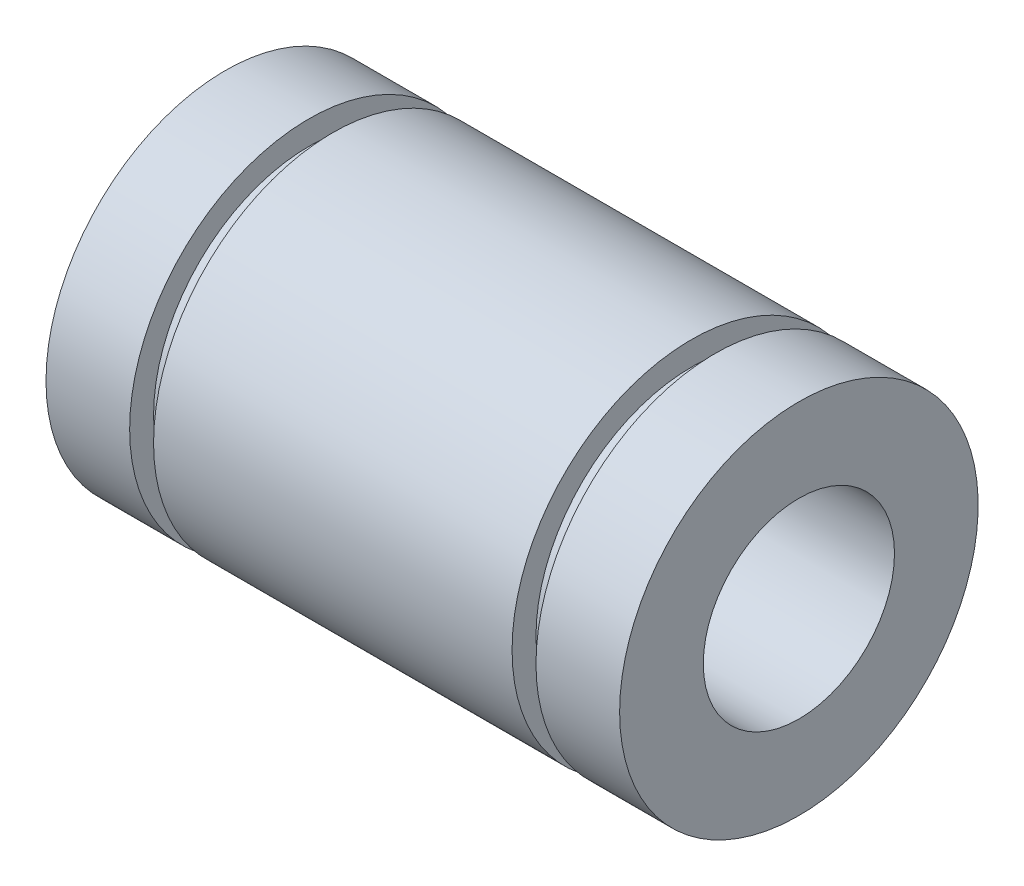
ISO-10303-21;
HEADER;
FILE_DESCRIPTION(('STEP AP214'),'2;1');
FILE_NAME('part.step','',(''),(''),'','','');
FILE_SCHEMA(('AUTOMOTIVE_DESIGN { 1 0 10303 214 1 1 1 1 }'));
ENDSEC;
DATA;
#1=APPLICATION_CONTEXT('core data for automotive mechanical design processes');
#2=APPLICATION_PROTOCOL_DEFINITION('international standard','automotive_design',2000,#1);
#3=PRODUCT_CONTEXT('',#1,'mechanical');
#4=PRODUCT('Part','Part','',(#3));
#5=PRODUCT_RELATED_PRODUCT_CATEGORY('part','',(#4));
#6=PRODUCT_DEFINITION_FORMATION('','',#4);
#7=PRODUCT_DEFINITION_CONTEXT('part definition',#1,'design');
#8=PRODUCT_DEFINITION('design','',#6,#7);
#9=PRODUCT_DEFINITION_SHAPE('','',#8);
#10=(LENGTH_UNIT() NAMED_UNIT(*) SI_UNIT(.MILLI.,.METRE.));
#11=(NAMED_UNIT(*) PLANE_ANGLE_UNIT() SI_UNIT($,.RADIAN.));
#12=(NAMED_UNIT(*) SI_UNIT($,.STERADIAN.) SOLID_ANGLE_UNIT());
#13=UNCERTAINTY_MEASURE_WITH_UNIT(LENGTH_MEASURE(1.E-05),#10,'distance_accuracy_value','');
#14=(GEOMETRIC_REPRESENTATION_CONTEXT(3) GLOBAL_UNCERTAINTY_ASSIGNED_CONTEXT((#13)) GLOBAL_UNIT_ASSIGNED_CONTEXT((#10,
#11,#12)) REPRESENTATION_CONTEXT('',''));
#15=CARTESIAN_POINT('',(0.,0.,0.));
#16=DIRECTION('',(0.,0.,1.));
#17=DIRECTION('',(1.,0.,0.));
#18=AXIS2_PLACEMENT_3D('',#15,#16,#17);
#19=CARTESIAN_POINT('',(0.,0.,0.));
#20=DIRECTION('',(-1.,0.,0.));
#21=DIRECTION('',(0.,0.,1.));
#22=AXIS2_PLACEMENT_3D('',#19,#20,#21);
#23=CYLINDRICAL_SURFACE('',#22,4.);
#24=CARTESIAN_POINT('',(24.,0.,0.));
#25=DIRECTION('',(-1.,0.,0.));
#26=DIRECTION('',(0.,0.,1.));
#27=AXIS2_PLACEMENT_3D('',#24,#25,#26);
#28=CIRCLE('',#27,4.);
#29=CARTESIAN_POINT('',(24.,0.,4.));
#30=VERTEX_POINT('',#29);
#31=EDGE_CURVE('E10',#30,#30,#28,.T.);
#32=ORIENTED_EDGE('',*,*,#31,.F.);
#33=EDGE_LOOP('',(#32));
#34=FACE_BOUND('',#33,.T.);
#35=CARTESIAN_POINT('',(0.,0.,0.));
#36=DIRECTION('',(-1.,0.,0.));
#37=DIRECTION('',(0.,0.,1.));
#38=AXIS2_PLACEMENT_3D('',#35,#36,#37);
#39=CIRCLE('',#38,4.);
#40=CARTESIAN_POINT('',(0.,0.,4.));
#41=VERTEX_POINT('',#40);
#42=EDGE_CURVE('E71',#41,#41,#39,.T.);
#43=ORIENTED_EDGE('',*,*,#42,.T.);
#44=EDGE_LOOP('',(#43));
#45=FACE_BOUND('',#44,.T.);
#46=ADVANCED_FACE('F31',(#34,#45),#23,.F.);
#47=CARTESIAN_POINT('',(24.,4.,0.));
#48=DIRECTION('',(-1.,0.,0.));
#49=DIRECTION('',(0.,0.,1.));
#50=AXIS2_PLACEMENT_3D('',#47,#48,#49);
#51=PLANE('',#50);
#52=CARTESIAN_POINT('',(24.,0.,0.));
#53=DIRECTION('',(-1.,0.,0.));
#54=DIRECTION('',(0.,0.,1.));
#55=AXIS2_PLACEMENT_3D('',#52,#53,#54);
#56=CIRCLE('',#55,7.5);
#57=CARTESIAN_POINT('',(24.,0.,7.5));
#58=VERTEX_POINT('',#57);
#59=EDGE_CURVE('E37',#58,#58,#56,.T.);
#60=ORIENTED_EDGE('',*,*,#59,.F.);
#61=EDGE_LOOP('',(#60));
#62=FACE_BOUND('',#61,.T.);
#63=ORIENTED_EDGE('',*,*,#31,.T.);
#64=EDGE_LOOP('',(#63));
#65=FACE_BOUND('',#64,.T.);
#66=ADVANCED_FACE('F100',(#62,#65),#51,.F.);
#67=CARTESIAN_POINT('',(0.,0.,0.));
#68=DIRECTION('',(-1.,0.,0.));
#69=DIRECTION('',(0.,0.,1.));
#70=AXIS2_PLACEMENT_3D('',#67,#68,#69);
#71=CYLINDRICAL_SURFACE('',#70,7.5);
#72=CARTESIAN_POINT('',(20.5,0.,0.));
#73=DIRECTION('',(-1.,0.,0.));
#74=DIRECTION('',(0.,0.,1.));
#75=AXIS2_PLACEMENT_3D('',#72,#73,#74);
#76=CIRCLE('',#75,7.5);
#77=CARTESIAN_POINT('',(20.5,0.,7.5));
#78=VERTEX_POINT('',#77);
#79=EDGE_CURVE('E41',#78,#78,#76,.T.);
#80=ORIENTED_EDGE('',*,*,#79,.F.);
#81=EDGE_LOOP('',(#80));
#82=FACE_BOUND('',#81,.T.);
#83=ORIENTED_EDGE('',*,*,#59,.T.);
#84=EDGE_LOOP('',(#83));
#85=FACE_BOUND('',#84,.T.);
#86=ADVANCED_FACE('F105',(#82,#85),#71,.T.);
#87=CARTESIAN_POINT('',(20.5,7.5,0.));
#88=DIRECTION('',(1.,0.,0.));
#89=DIRECTION('',(0.,0.,-1.));
#90=AXIS2_PLACEMENT_3D('',#87,#88,#89);
#91=PLANE('',#90);
#92=CARTESIAN_POINT('',(20.5,0.,0.));
#93=DIRECTION('',(-1.,0.,0.));
#94=DIRECTION('',(0.,0.,1.));
#95=AXIS2_PLACEMENT_3D('',#92,#93,#94);
#96=CIRCLE('',#95,6.5);
#97=CARTESIAN_POINT('',(20.5,0.,6.5));
#98=VERTEX_POINT('',#97);
#99=EDGE_CURVE('E45',#98,#98,#96,.T.);
#100=ORIENTED_EDGE('',*,*,#99,.F.);
#101=EDGE_LOOP('',(#100));
#102=FACE_BOUND('',#101,.T.);
#103=ORIENTED_EDGE('',*,*,#79,.T.);
#104=EDGE_LOOP('',(#103));
#105=FACE_BOUND('',#104,.T.);
#106=ADVANCED_FACE('F110',(#102,#105),#91,.F.);
#107=CARTESIAN_POINT('',(0.,0.,0.));
#108=DIRECTION('',(-1.,0.,0.));
#109=DIRECTION('',(0.,0.,1.));
#110=AXIS2_PLACEMENT_3D('',#107,#108,#109);
#111=CYLINDRICAL_SURFACE('',#110,6.5);
#112=ORIENTED_EDGE('',*,*,#99,.T.);
#113=EDGE_LOOP('',(#112));
#114=FACE_BOUND('',#113,.T.);
#115=CARTESIAN_POINT('',(19.5,0.,0.));
#116=DIRECTION('',(-1.,0.,0.));
#117=DIRECTION('',(0.,0.,1.));
#118=AXIS2_PLACEMENT_3D('',#115,#116,#117);
#119=CIRCLE('',#118,6.5);
#120=CARTESIAN_POINT('',(19.5,0.,6.5));
#121=VERTEX_POINT('',#120);
#122=EDGE_CURVE('E50',#121,#121,#119,.T.);
#123=ORIENTED_EDGE('',*,*,#122,.F.);
#124=EDGE_LOOP('',(#123));
#125=FACE_BOUND('',#124,.T.);
#126=ADVANCED_FACE('F116',(#114,#125),#111,.T.);
#127=CARTESIAN_POINT('',(19.5,7.5,0.));
#128=DIRECTION('',(1.,0.,0.));
#129=DIRECTION('',(0.,0.,-1.));
#130=AXIS2_PLACEMENT_3D('',#127,#128,#129);
#131=PLANE('',#130);
#132=ORIENTED_EDGE('',*,*,#122,.T.);
#133=EDGE_LOOP('',(#132));
#134=FACE_BOUND('',#133,.T.);
#135=CARTESIAN_POINT('',(19.5,0.,0.));
#136=DIRECTION('',(-1.,0.,0.));
#137=DIRECTION('',(0.,0.,1.));
#138=AXIS2_PLACEMENT_3D('',#135,#136,#137);
#139=CIRCLE('',#138,7.5);
#140=CARTESIAN_POINT('',(19.5,0.,7.5));
#141=VERTEX_POINT('',#140);
#142=EDGE_CURVE('E53',#141,#141,#139,.T.);
#143=ORIENTED_EDGE('',*,*,#142,.F.);
#144=EDGE_LOOP('',(#143));
#145=FACE_BOUND('',#144,.T.);
#146=ADVANCED_FACE('F120',(#134,#145),#131,.T.);
#147=CARTESIAN_POINT('',(0.,0.,0.));
#148=DIRECTION('',(-1.,0.,0.));
#149=DIRECTION('',(0.,0.,1.));
#150=AXIS2_PLACEMENT_3D('',#147,#148,#149);
#151=CYLINDRICAL_SURFACE('',#150,7.5);
#152=CARTESIAN_POINT('',(4.5,0.,0.));
#153=DIRECTION('',(-1.,0.,0.));
#154=DIRECTION('',(0.,0.,1.));
#155=AXIS2_PLACEMENT_3D('',#152,#153,#154);
#156=CIRCLE('',#155,7.5);
#157=CARTESIAN_POINT('',(4.5,0.,7.5));
#158=VERTEX_POINT('',#157);
#159=EDGE_CURVE('E56',#158,#158,#156,.T.);
#160=ORIENTED_EDGE('',*,*,#159,.F.);
#161=EDGE_LOOP('',(#160));
#162=FACE_BOUND('',#161,.T.);
#163=ORIENTED_EDGE('',*,*,#142,.T.);
#164=EDGE_LOOP('',(#163));
#165=FACE_BOUND('',#164,.T.);
#166=ADVANCED_FACE('F124',(#162,#165),#151,.T.);
#167=CARTESIAN_POINT('',(4.5,7.5,0.));
#168=DIRECTION('',(1.,0.,0.));
#169=DIRECTION('',(0.,0.,-1.));
#170=AXIS2_PLACEMENT_3D('',#167,#168,#169);
#171=PLANE('',#170);
#172=CARTESIAN_POINT('',(4.5,0.,0.));
#173=DIRECTION('',(-1.,0.,0.));
#174=DIRECTION('',(0.,0.,1.));
#175=AXIS2_PLACEMENT_3D('',#172,#173,#174);
#176=CIRCLE('',#175,6.5);
#177=CARTESIAN_POINT('',(4.5,0.,6.5));
#178=VERTEX_POINT('',#177);
#179=EDGE_CURVE('E59',#178,#178,#176,.T.);
#180=ORIENTED_EDGE('',*,*,#179,.F.);
#181=EDGE_LOOP('',(#180));
#182=FACE_BOUND('',#181,.T.);
#183=ORIENTED_EDGE('',*,*,#159,.T.);
#184=EDGE_LOOP('',(#183));
#185=FACE_BOUND('',#184,.T.);
#186=ADVANCED_FACE('F96',(#182,#185),#171,.F.);
#187=CARTESIAN_POINT('',(0.,0.,0.));
#188=DIRECTION('',(-1.,0.,0.));
#189=DIRECTION('',(0.,0.,1.));
#190=AXIS2_PLACEMENT_3D('',#187,#188,#189);
#191=CYLINDRICAL_SURFACE('',#190,6.5);
#192=CARTESIAN_POINT('',(3.5,0.,0.));
#193=DIRECTION('',(-1.,0.,0.));
#194=DIRECTION('',(0.,0.,1.));
#195=AXIS2_PLACEMENT_3D('',#192,#193,#194);
#196=CIRCLE('',#195,6.5);
#197=CARTESIAN_POINT('',(3.5,0.,6.5));
#198=VERTEX_POINT('',#197);
#199=EDGE_CURVE('E62',#198,#198,#196,.T.);
#200=ORIENTED_EDGE('',*,*,#199,.F.);
#201=EDGE_LOOP('',(#200));
#202=FACE_BOUND('',#201,.T.);
#203=ORIENTED_EDGE('',*,*,#179,.T.);
#204=EDGE_LOOP('',(#203));
#205=FACE_BOUND('',#204,.T.);
#206=ADVANCED_FACE('F90',(#202,#205),#191,.T.);
#207=CARTESIAN_POINT('',(3.5,7.5,0.));
#208=DIRECTION('',(1.,0.,0.));
#209=DIRECTION('',(0.,0.,-1.));
#210=AXIS2_PLACEMENT_3D('',#207,#208,#209);
#211=PLANE('',#210);
#212=ORIENTED_EDGE('',*,*,#199,.T.);
#213=EDGE_LOOP('',(#212));
#214=FACE_BOUND('',#213,.T.);
#215=CARTESIAN_POINT('',(3.5,0.,0.));
#216=DIRECTION('',(-1.,0.,0.));
#217=DIRECTION('',(0.,0.,1.));
#218=AXIS2_PLACEMENT_3D('',#215,#216,#217);
#219=CIRCLE('',#218,7.5);
#220=CARTESIAN_POINT('',(3.5,0.,7.5));
#221=VERTEX_POINT('',#220);
#222=EDGE_CURVE('E65',#221,#221,#219,.T.);
#223=ORIENTED_EDGE('',*,*,#222,.F.);
#224=EDGE_LOOP('',(#223));
#225=FACE_BOUND('',#224,.T.);
#226=ADVANCED_FACE('F85',(#214,#225),#211,.T.);
#227=CARTESIAN_POINT('',(0.,0.,0.));
#228=DIRECTION('',(-1.,0.,0.));
#229=DIRECTION('',(0.,0.,1.));
#230=AXIS2_PLACEMENT_3D('',#227,#228,#229);
#231=CYLINDRICAL_SURFACE('',#230,7.5);
#232=CARTESIAN_POINT('',(0.,0.,0.));
#233=DIRECTION('',(-1.,0.,0.));
#234=DIRECTION('',(0.,0.,1.));
#235=AXIS2_PLACEMENT_3D('',#232,#233,#234);
#236=CIRCLE('',#235,7.5);
#237=CARTESIAN_POINT('',(0.,0.,7.5));
#238=VERTEX_POINT('',#237);
#239=EDGE_CURVE('E68',#238,#238,#236,.T.);
#240=ORIENTED_EDGE('',*,*,#239,.F.);
#241=EDGE_LOOP('',(#240));
#242=FACE_BOUND('',#241,.T.);
#243=ORIENTED_EDGE('',*,*,#222,.T.);
#244=EDGE_LOOP('',(#243));
#245=FACE_BOUND('',#244,.T.);
#246=ADVANCED_FACE('F79',(#242,#245),#231,.T.);
#247=CARTESIAN_POINT('',(0.,7.5,0.));
#248=DIRECTION('',(1.,0.,0.));
#249=DIRECTION('',(0.,0.,-1.));
#250=AXIS2_PLACEMENT_3D('',#247,#248,#249);
#251=PLANE('',#250);
#252=ORIENTED_EDGE('',*,*,#42,.F.);
#253=EDGE_LOOP('',(#252));
#254=FACE_BOUND('',#253,.T.);
#255=ORIENTED_EDGE('',*,*,#239,.T.);
#256=EDGE_LOOP('',(#255));
#257=FACE_BOUND('',#256,.T.);
#258=ADVANCED_FACE('F76',(#254,#257),#251,.F.);
#259=CLOSED_SHELL('',(#46,#66,#86,#106,#126,#146,#166,#186,#206,#226,#246,#258));
#260=MANIFOLD_SOLID_BREP('B2',#259);
#261=ADVANCED_BREP_SHAPE_REPRESENTATION('',(#18,#260),#14);
#262=SHAPE_DEFINITION_REPRESENTATION(#9,#261);
ENDSEC;
END-ISO-10303-21;
